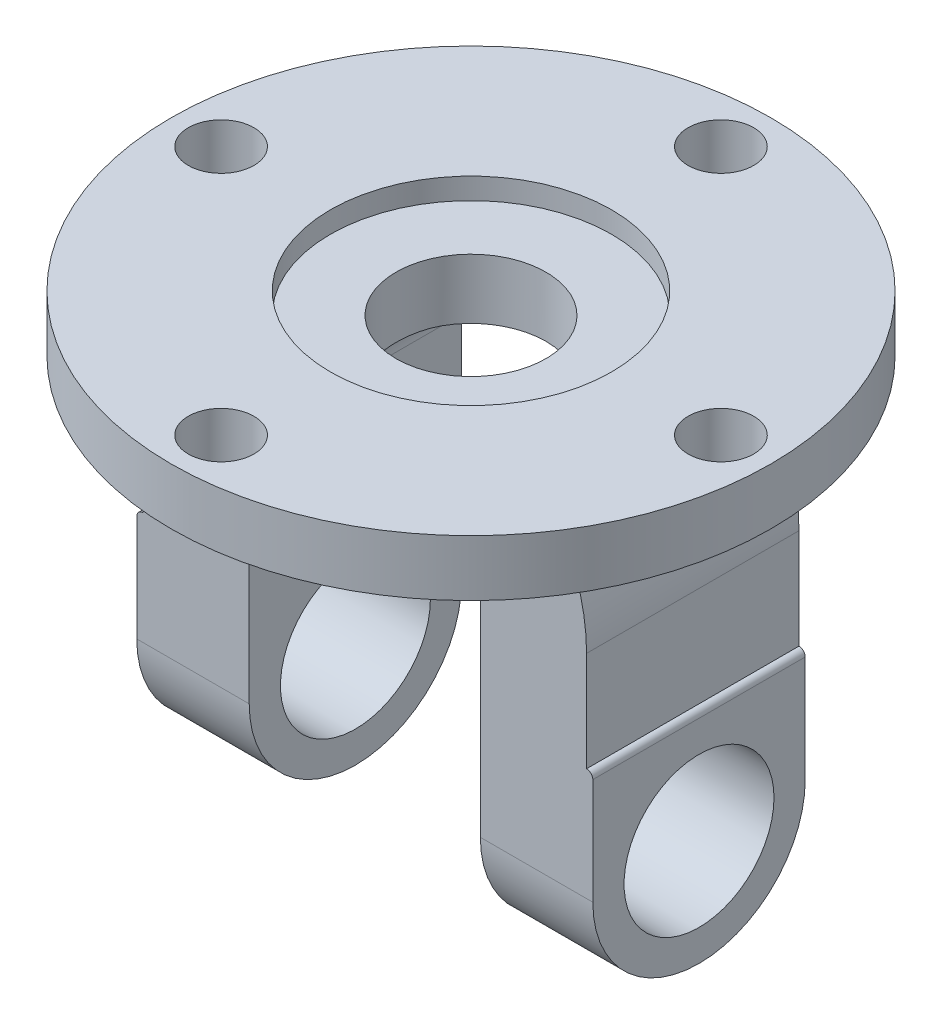
ISO-10303-21;
HEADER;
FILE_DESCRIPTION(('STEP AP214'),'2;1');
FILE_NAME('part.step','',(''),(''),'','','');
FILE_SCHEMA(('AUTOMOTIVE_DESIGN { 1 0 10303 214 1 1 1 1 }'));
ENDSEC;
DATA;
#1=APPLICATION_CONTEXT('core data for automotive mechanical design processes');
#2=APPLICATION_PROTOCOL_DEFINITION('international standard','automotive_design',2000,#1);
#3=PRODUCT_CONTEXT('',#1,'mechanical');
#4=PRODUCT('Part','Part','',(#3));
#5=PRODUCT_RELATED_PRODUCT_CATEGORY('part','',(#4));
#6=PRODUCT_DEFINITION_FORMATION('','',#4);
#7=PRODUCT_DEFINITION_CONTEXT('part definition',#1,'design');
#8=PRODUCT_DEFINITION('design','',#6,#7);
#9=PRODUCT_DEFINITION_SHAPE('','',#8);
#10=(LENGTH_UNIT() NAMED_UNIT(*) SI_UNIT(.MILLI.,.METRE.));
#11=(NAMED_UNIT(*) PLANE_ANGLE_UNIT() SI_UNIT($,.RADIAN.));
#12=(NAMED_UNIT(*) SI_UNIT($,.STERADIAN.) SOLID_ANGLE_UNIT());
#13=UNCERTAINTY_MEASURE_WITH_UNIT(LENGTH_MEASURE(1.E-05),#10,'distance_accuracy_value','');
#14=(GEOMETRIC_REPRESENTATION_CONTEXT(3) GLOBAL_UNCERTAINTY_ASSIGNED_CONTEXT((#13)) GLOBAL_UNIT_ASSIGNED_CONTEXT((#10,
#11,#12)) REPRESENTATION_CONTEXT('',''));
#15=CARTESIAN_POINT('',(0.,0.,0.));
#16=DIRECTION('',(0.,0.,1.));
#17=DIRECTION('',(1.,0.,0.));
#18=AXIS2_PLACEMENT_3D('',#15,#16,#17);
#19=CARTESIAN_POINT('',(10.5,-12.,-17.));
#20=DIRECTION('',(0.,0.,1.));
#21=DIRECTION('',(1.,0.,0.));
#22=AXIS2_PLACEMENT_3D('',#19,#20,#21);
#23=CYLINDRICAL_SURFACE('',#22,8.);
#24=DIRECTION('',(0.,0.,1.));
#25=VECTOR('',#24,1.);
#26=CARTESIAN_POINT('',(10.5,-4.,-17.));
#27=LINE('',#26,#25);
#28=CARTESIAN_POINT('',(10.5,-4.,5.80947501931113));
#29=VERTEX_POINT('',#28);
#30=CARTESIAN_POINT('',(10.5,-4.,17.));
#31=VERTEX_POINT('',#30);
#32=EDGE_CURVE('E221',#29,#31,#27,.T.);
#33=ORIENTED_EDGE('',*,*,#32,.F.);
#34=CARTESIAN_POINT('',(10.5,-4.,5.80947501931113));
#35=CARTESIAN_POINT('',(10.582396313583,-4.00000478507137,5.66055313742475));
#36=CARTESIAN_POINT('',(10.6616097143964,-4.0012723056501,5.50990261729896));
#37=CARTESIAN_POINT('',(10.8135435976927,-4.00578458406282,5.2054037349143));
#38=CARTESIAN_POINT('',(10.8862645502737,-4.00902919860814,5.05155560518061));
#39=CARTESIAN_POINT('',(11.0944631169157,-4.02090380732131,4.58568801382884));
#40=CARTESIAN_POINT('',(11.2200386237681,-4.03167539543472,4.26923291166803));
#41=CARTESIAN_POINT('',(11.4436209860505,-4.05505225948348,3.62750903118995));
#42=CARTESIAN_POINT('',(11.5416782862418,-4.06765411504085,3.30225759429498));
#43=CARTESIAN_POINT('',(11.7098899459498,-4.09156179595261,2.64455455547074));
#44=CARTESIAN_POINT('',(11.7800444650853,-4.10286762872069,2.31210299474154));
#45=CARTESIAN_POINT('',(11.8912362108495,-4.121700209188,1.64649381657088));
#46=CARTESIAN_POINT('',(11.9326231474557,-4.12927200791181,1.31339588986459));
#47=CARTESIAN_POINT('',(11.9873551544606,-4.13943031134307,0.644827293568663));
#48=CARTESIAN_POINT('',(12.0007007047885,-4.14201690137245,0.309356664686493));
#49=CARTESIAN_POINT('',(11.9992426238098,-4.14173863548621,-0.361512432389894));
#50=CARTESIAN_POINT('',(11.9844396851411,-4.13887391370869,-0.696910902156599));
#51=CARTESIAN_POINT('',(11.9268057364954,-4.12820995164931,-1.36520994455079));
#52=CARTESIAN_POINT('',(11.8839743880088,-4.12041065177072,-1.69811048696075));
#53=CARTESIAN_POINT('',(11.7706273543271,-4.10134199323106,-2.35895944365431));
#54=CARTESIAN_POINT('',(11.7001197645568,-4.09007364948859,-2.68690927693927));
#55=CARTESIAN_POINT('',(11.5319303271071,-4.0663802689378,-3.33570216150465));
#56=CARTESIAN_POINT('',(11.434248760218,-4.05395524408241,-3.65654528618214));
#57=CARTESIAN_POINT('',(11.2121409740726,-4.0309763971499,-4.28958787322845));
#58=CARTESIAN_POINT('',(11.0876687830823,-4.02042584913863,-4.60177142334791));
#59=CARTESIAN_POINT('',(10.8816390646415,-4.0088131751189,-5.06143876893123));
#60=CARTESIAN_POINT('',(10.8097265842562,-4.00564427138495,-5.21325488570857));
#61=CARTESIAN_POINT('',(10.6595768848512,-4.00123988920433,-5.5137674667867));
#62=CARTESIAN_POINT('',(10.5813392190539,-4.00000454745995,-5.66246370978015));
#63=CARTESIAN_POINT('',(10.5,-4.,-5.80947501931113));
#64=B_SPLINE_CURVE_WITH_KNOTS('',3,(#34,#35,#36,#37,#38,#39,#40,#41,#42,#43,#44,#45,#46,#47,#48,
#49,#50,#51,#52,#53,#54,#55,#56,#57,#58,#59,#60,#61,#62,#63),.UNSPECIFIED.,.F.,.F.,(4,2,2,2,2,2,
2,2,2,2,2,2,2,2,4),(0.,0.510494259529536,1.02095152570326,2.04148191159962,3.06012911540456,
4.07877049191324,5.08480145699294,6.09081520368634,7.09680419614827,8.10280533854436,
9.10851244010665,10.1142091500197,11.121645556677,11.6255573664657,12.1295048010668),.UNSPECIFIED.);
#65=CARTESIAN_POINT('',(10.5,-4.,-5.80947501931113));
#66=VERTEX_POINT('',#65);
#67=EDGE_CURVE('E298',#29,#66,#64,.T.);
#68=ORIENTED_EDGE('',*,*,#67,.T.);
#69=CARTESIAN_POINT('',(10.5,-4.,-17.));
#70=VERTEX_POINT('',#69);
#71=EDGE_CURVE('E218',#70,#66,#27,.T.);
#72=ORIENTED_EDGE('',*,*,#71,.F.);
#73=CARTESIAN_POINT('',(10.5,-12.,-17.));
#74=DIRECTION('',(0.,0.,-1.));
#75=DIRECTION('',(1.,0.,0.));
#76=AXIS2_PLACEMENT_3D('',#73,#74,#75);
#77=CIRCLE('',#76,8.);
#78=CARTESIAN_POINT('',(18.5,-12.,-17.));
#79=VERTEX_POINT('',#78);
#80=EDGE_CURVE('E202',#70,#79,#77,.T.);
#81=ORIENTED_EDGE('',*,*,#80,.T.);
#82=DIRECTION('',(0.,0.,1.));
#83=VECTOR('',#82,1.);
#84=CARTESIAN_POINT('',(18.5,-12.,-17.));
#85=LINE('',#84,#83);
#86=CARTESIAN_POINT('',(18.5,-12.,17.));
#87=VERTEX_POINT('',#86);
#88=EDGE_CURVE('E216',#79,#87,#85,.T.);
#89=ORIENTED_EDGE('',*,*,#88,.T.);
#90=CARTESIAN_POINT('',(10.5,-12.,17.));
#91=DIRECTION('',(0.,0.,-1.));
#92=DIRECTION('',(1.,0.,0.));
#93=AXIS2_PLACEMENT_3D('',#90,#91,#92);
#94=CIRCLE('',#93,8.);
#95=EDGE_CURVE('E354',#31,#87,#94,.T.);
#96=ORIENTED_EDGE('',*,*,#95,.F.);
#97=EDGE_LOOP('',(#33,#68,#72,#81,#89,#96));
#98=FACE_BOUND('',#97,.T.);
#99=ADVANCED_FACE('F49',(#98),#23,.F.);
#100=CARTESIAN_POINT('',(-10.5,-4.,-17.));
#101=DIRECTION('',(0.,-1.,0.));
#102=DIRECTION('',(0.,0.,-1.));
#103=AXIS2_PLACEMENT_3D('',#100,#101,#102);
#104=PLANE('',#103);
#105=DIRECTION('',(0.,0.,1.));
#106=VECTOR('',#105,1.);
#107=CARTESIAN_POINT('',(-10.5,-4.,-17.));
#108=LINE('',#107,#106);
#109=CARTESIAN_POINT('',(-10.5,-4.,5.80947501931113));
#110=VERTEX_POINT('',#109);
#111=CARTESIAN_POINT('',(-10.5,-4.,17.));
#112=VERTEX_POINT('',#111);
#113=EDGE_CURVE('E225',#110,#112,#108,.T.);
#114=ORIENTED_EDGE('',*,*,#113,.F.);
#115=CARTESIAN_POINT('',(0.,-4.,0.));
#116=DIRECTION('',(0.,-1.,0.));
#117=DIRECTION('',(0.,0.,-1.));
#118=AXIS2_PLACEMENT_3D('',#115,#116,#117);
#119=CIRCLE('',#118,12.);
#120=EDGE_CURVE('E308',#110,#29,#119,.F.);
#121=ORIENTED_EDGE('',*,*,#120,.T.);
#122=ORIENTED_EDGE('',*,*,#32,.T.);
#123=DIRECTION('',(1.,0.,0.));
#124=VECTOR('',#123,1.);
#125=CARTESIAN_POINT('',(-10.5,-4.,17.));
#126=LINE('',#125,#124);
#127=EDGE_CURVE('E342',#112,#31,#126,.T.);
#128=ORIENTED_EDGE('',*,*,#127,.F.);
#129=EDGE_LOOP('',(#114,#121,#122,#128));
#130=FACE_BOUND('',#129,.T.);
#131=ADVANCED_FACE('F313',(#130),#104,.T.);
#132=CARTESIAN_POINT('',(-10.5,-12.,-17.));
#133=DIRECTION('',(0.,0.,1.));
#134=DIRECTION('',(1.,0.,0.));
#135=AXIS2_PLACEMENT_3D('',#132,#133,#134);
#136=CYLINDRICAL_SURFACE('',#135,8.);
#137=CARTESIAN_POINT('',(-10.5,-4.,-17.));
#138=VERTEX_POINT('',#137);
#139=CARTESIAN_POINT('',(-10.5,-4.,-5.80947501931113));
#140=VERTEX_POINT('',#139);
#141=EDGE_CURVE('E222',#138,#140,#108,.T.);
#142=ORIENTED_EDGE('',*,*,#141,.T.);
#143=CARTESIAN_POINT('',(-10.5,-4.,-5.80947501931113));
#144=CARTESIAN_POINT('',(-10.582396313583,-4.00000478507137,-5.66055313742475));
#145=CARTESIAN_POINT('',(-10.6616097143964,-4.0012723056501,-5.50990261729896));
#146=CARTESIAN_POINT('',(-10.8135435976927,-4.00578458406282,-5.2054037349143));
#147=CARTESIAN_POINT('',(-10.8862645502737,-4.00902919860814,-5.05155560518061));
#148=CARTESIAN_POINT('',(-11.0944631169157,-4.02090380732131,-4.58568801382884));
#149=CARTESIAN_POINT('',(-11.2200386237681,-4.03167539543472,-4.26923291166803));
#150=CARTESIAN_POINT('',(-11.4436209860505,-4.05505225948348,-3.62750903118995));
#151=CARTESIAN_POINT('',(-11.5416782862418,-4.06765411504085,-3.30225759429498));
#152=CARTESIAN_POINT('',(-11.7098899459498,-4.09156179595261,-2.64455455547074));
#153=CARTESIAN_POINT('',(-11.7800444650853,-4.10286762872069,-2.31210299474154));
#154=CARTESIAN_POINT('',(-11.8912362108495,-4.121700209188,-1.64649381657088));
#155=CARTESIAN_POINT('',(-11.9326231474557,-4.12927200791181,-1.31339588986459));
#156=CARTESIAN_POINT('',(-11.9873551544606,-4.13943031134307,-0.644827293568663));
#157=CARTESIAN_POINT('',(-12.0007007047885,-4.14201690137245,-0.309356664686493));
#158=CARTESIAN_POINT('',(-11.9992426238098,-4.14173863548621,0.361512432389894));
#159=CARTESIAN_POINT('',(-11.9844396851411,-4.13887391370869,0.696910902156599));
#160=CARTESIAN_POINT('',(-11.9268057364954,-4.12820995164931,1.36520994455079));
#161=CARTESIAN_POINT('',(-11.8839743880088,-4.12041065177072,1.69811048696075));
#162=CARTESIAN_POINT('',(-11.7706273543271,-4.10134199323106,2.35895944365431));
#163=CARTESIAN_POINT('',(-11.7001197645568,-4.09007364948859,2.68690927693927));
#164=CARTESIAN_POINT('',(-11.5319303271071,-4.0663802689378,3.33570216150465));
#165=CARTESIAN_POINT('',(-11.434248760218,-4.05395524408241,3.65654528618214));
#166=CARTESIAN_POINT('',(-11.2121409740726,-4.0309763971499,4.28958787322845));
#167=CARTESIAN_POINT('',(-11.0876687830823,-4.02042584913863,4.60177142334791));
#168=CARTESIAN_POINT('',(-10.8816390646415,-4.0088131751189,5.06143876893123));
#169=CARTESIAN_POINT('',(-10.8097265842562,-4.00564427138495,5.21325488570857));
#170=CARTESIAN_POINT('',(-10.6595768848512,-4.00123988920433,5.5137674667867));
#171=CARTESIAN_POINT('',(-10.5813392190539,-4.00000454745995,5.66246370978015));
#172=CARTESIAN_POINT('',(-10.5,-4.,5.80947501931113));
#173=B_SPLINE_CURVE_WITH_KNOTS('',3,(#143,#144,#145,#146,#147,#148,#149,#150,#151,#152,#153,
#154,#155,#156,#157,#158,#159,#160,#161,#162,#163,#164,#165,#166,#167,#168,#169,#170,#171,#172),
.UNSPECIFIED.,.F.,.F.,(4,2,2,2,2,2,2,2,2,2,2,2,2,2,4),(0.,0.510494259529536,1.02095152570326,
2.04148191159962,3.06012911540456,4.07877049191324,5.08480145699294,6.09081520368634,
7.09680419614827,8.10280533854436,9.10851244010665,10.1142091500197,11.121645556677,
11.6255573664657,12.1295048010668),.UNSPECIFIED.);
#174=EDGE_CURVE('E275',#140,#110,#173,.T.);
#175=ORIENTED_EDGE('',*,*,#174,.T.);
#176=ORIENTED_EDGE('',*,*,#113,.T.);
#177=CARTESIAN_POINT('',(-10.5,-12.,17.));
#178=DIRECTION('',(0.,0.,-1.));
#179=DIRECTION('',(-1.,0.,0.));
#180=AXIS2_PLACEMENT_3D('',#177,#178,#179);
#181=CIRCLE('',#180,8.);
#182=CARTESIAN_POINT('',(-18.5,-12.,17.));
#183=VERTEX_POINT('',#182);
#184=EDGE_CURVE('E346',#183,#112,#181,.T.);
#185=ORIENTED_EDGE('',*,*,#184,.F.);
#186=DIRECTION('',(0.,0.,1.));
#187=VECTOR('',#186,1.);
#188=CARTESIAN_POINT('',(-18.5,-12.,-17.));
#189=LINE('',#188,#187);
#190=CARTESIAN_POINT('',(-18.5,-12.,-17.));
#191=VERTEX_POINT('',#190);
#192=EDGE_CURVE('E226',#191,#183,#189,.T.);
#193=ORIENTED_EDGE('',*,*,#192,.F.);
#194=CARTESIAN_POINT('',(-10.5,-12.,-17.));
#195=DIRECTION('',(0.,0.,-1.));
#196=DIRECTION('',(-1.,0.,0.));
#197=AXIS2_PLACEMENT_3D('',#194,#195,#196);
#198=CIRCLE('',#197,8.);
#199=EDGE_CURVE('E390',#191,#138,#198,.T.);
#200=ORIENTED_EDGE('',*,*,#199,.T.);
#201=EDGE_LOOP('',(#142,#175,#176,#185,#193,#200));
#202=FACE_BOUND('',#201,.T.);
#203=ADVANCED_FACE('F285',(#202),#136,.F.);
#204=CARTESIAN_POINT('',(0.,9.,0.));
#205=DIRECTION('',(0.,1.,0.));
#206=DIRECTION('',(0.,0.,1.));
#207=AXIS2_PLACEMENT_3D('',#204,#205,#206);
#208=PLANE('',#207);
#209=CARTESIAN_POINT('',(0.,9.,0.));
#210=DIRECTION('',(0.,1.,0.));
#211=DIRECTION('',(0.,0.,1.));
#212=AXIS2_PLACEMENT_3D('',#209,#210,#211);
#213=CIRCLE('',#212,22.5);
#214=CARTESIAN_POINT('',(0.,9.,22.5));
#215=VERTEX_POINT('',#214);
#216=EDGE_CURVE('E241',#215,#215,#213,.T.);
#217=ORIENTED_EDGE('',*,*,#216,.F.);
#218=EDGE_LOOP('',(#217));
#219=FACE_BOUND('',#218,.T.);
#220=CARTESIAN_POINT('',(2.25904099284255E-12,9.,40.));
#221=DIRECTION('',(0.,1.,0.));
#222=DIRECTION('',(0.,0.,1.));
#223=AXIS2_PLACEMENT_3D('',#220,#221,#222);
#224=CIRCLE('',#223,5.25000000000243);
#225=CARTESIAN_POINT('',(2.25904099284255E-12,9.,45.2500000000024));
#226=VERTEX_POINT('',#225);
#227=EDGE_CURVE('E254',#226,#226,#224,.T.);
#228=ORIENTED_EDGE('',*,*,#227,.F.);
#229=EDGE_LOOP('',(#228));
#230=FACE_BOUND('',#229,.T.);
#231=CARTESIAN_POINT('',(0.,9.,-40.));
#232=DIRECTION('',(0.,1.,0.));
#233=DIRECTION('',(0.,0.,1.));
#234=AXIS2_PLACEMENT_3D('',#231,#232,#233);
#235=CIRCLE('',#234,5.25);
#236=CARTESIAN_POINT('',(0.,9.,-34.75));
#237=VERTEX_POINT('',#236);
#238=EDGE_CURVE('E266',#237,#237,#235,.T.);
#239=ORIENTED_EDGE('',*,*,#238,.F.);
#240=EDGE_LOOP('',(#239));
#241=FACE_BOUND('',#240,.T.);
#242=CARTESIAN_POINT('',(0.,9.,0.));
#243=DIRECTION('',(0.,1.,0.));
#244=DIRECTION('',(0.,0.,1.));
#245=AXIS2_PLACEMENT_3D('',#242,#243,#244);
#246=CIRCLE('',#245,48.);
#247=CARTESIAN_POINT('',(0.,9.,48.));
#248=VERTEX_POINT('',#247);
#249=EDGE_CURVE('E272',#248,#248,#246,.T.);
#250=ORIENTED_EDGE('',*,*,#249,.T.);
#251=EDGE_LOOP('',(#250));
#252=FACE_BOUND('',#251,.T.);
#253=CARTESIAN_POINT('',(40.0000000000011,9.,-1.12952049642128E-12));
#254=DIRECTION('',(0.,1.,0.));
#255=DIRECTION('',(0.,0.,1.));
#256=AXIS2_PLACEMENT_3D('',#253,#254,#255);
#257=CIRCLE('',#256,5.25000000000088);
#258=CARTESIAN_POINT('',(40.0000000000011,9.,5.24999999999975));
#259=VERTEX_POINT('',#258);
#260=EDGE_CURVE('E260',#259,#259,#257,.T.);
#261=ORIENTED_EDGE('',*,*,#260,.F.);
#262=EDGE_LOOP('',(#261));
#263=FACE_BOUND('',#262,.T.);
#264=CARTESIAN_POINT('',(-39.9999999999989,9.,1.13441908361787E-12));
#265=DIRECTION('',(0.,1.,0.));
#266=DIRECTION('',(0.,0.,1.));
#267=AXIS2_PLACEMENT_3D('',#264,#265,#266);
#268=CIRCLE('',#267,5.25000000000181);
#269=CARTESIAN_POINT('',(-39.9999999999989,9.,5.25000000000295));
#270=VERTEX_POINT('',#269);
#271=EDGE_CURVE('E248',#270,#270,#268,.T.);
#272=ORIENTED_EDGE('',*,*,#271,.F.);
#273=EDGE_LOOP('',(#272));
#274=FACE_BOUND('',#273,.T.);
#275=ADVANCED_FACE('F335',(#219,#230,#241,#252,#263,#274),#208,.T.);
#276=CARTESIAN_POINT('',(0.,0.,0.));
#277=DIRECTION('',(0.,1.,0.));
#278=DIRECTION('',(0.,0.,1.));
#279=AXIS2_PLACEMENT_3D('',#276,#277,#278);
#280=PLANE('',#279);
#281=DIRECTION('',(-1.,0.,0.));
#282=VECTOR('',#281,1.);
#283=CARTESIAN_POINT('',(31.5,0.,-17.));
#284=LINE('',#283,#282);
#285=CARTESIAN_POINT('',(31.5,0.,-17.));
#286=VERTEX_POINT('',#285);
#287=CARTESIAN_POINT('',(-31.5,0.,-17.));
#288=VERTEX_POINT('',#287);
#289=EDGE_CURVE('E374',#286,#288,#284,.T.);
#290=ORIENTED_EDGE('',*,*,#289,.T.);
#291=DIRECTION('',(0.,0.,1.));
#292=VECTOR('',#291,1.);
#293=CARTESIAN_POINT('',(-31.5,0.,-17.));
#294=LINE('',#293,#292);
#295=CARTESIAN_POINT('',(-31.5,0.,17.));
#296=VERTEX_POINT('',#295);
#297=EDGE_CURVE('E235',#288,#296,#294,.T.);
#298=ORIENTED_EDGE('',*,*,#297,.T.);
#299=DIRECTION('',(-1.,0.,0.));
#300=VECTOR('',#299,1.);
#301=CARTESIAN_POINT('',(31.5,0.,17.));
#302=LINE('',#301,#300);
#303=CARTESIAN_POINT('',(31.5,0.,17.));
#304=VERTEX_POINT('',#303);
#305=EDGE_CURVE('E438',#304,#296,#302,.T.);
#306=ORIENTED_EDGE('',*,*,#305,.F.);
#307=DIRECTION('',(0.,0.,1.));
#308=VECTOR('',#307,1.);
#309=CARTESIAN_POINT('',(31.5,0.,-17.));
#310=LINE('',#309,#308);
#311=EDGE_CURVE('E208',#286,#304,#310,.T.);
#312=ORIENTED_EDGE('',*,*,#311,.F.);
#313=EDGE_LOOP('',(#290,#298,#306,#312));
#314=FACE_BOUND('',#313,.T.);
#315=CARTESIAN_POINT('',(0.,0.,0.));
#316=DIRECTION('',(0.,1.,0.));
#317=DIRECTION('',(0.,0.,1.));
#318=AXIS2_PLACEMENT_3D('',#315,#316,#317);
#319=CIRCLE('',#318,48.);
#320=CARTESIAN_POINT('',(0.,0.,48.));
#321=VERTEX_POINT('',#320);
#322=EDGE_CURVE('E269',#321,#321,#319,.T.);
#323=ORIENTED_EDGE('',*,*,#322,.F.);
#324=EDGE_LOOP('',(#323));
#325=FACE_BOUND('',#324,.T.);
#326=CARTESIAN_POINT('',(0.,0.,-40.));
#327=DIRECTION('',(0.,1.,0.));
#328=DIRECTION('',(0.,0.,1.));
#329=AXIS2_PLACEMENT_3D('',#326,#327,#328);
#330=CIRCLE('',#329,5.25);
#331=CARTESIAN_POINT('',(0.,0.,-34.75));
#332=VERTEX_POINT('',#331);
#333=EDGE_CURVE('E263',#332,#332,#330,.T.);
#334=ORIENTED_EDGE('',*,*,#333,.T.);
#335=EDGE_LOOP('',(#334));
#336=FACE_BOUND('',#335,.T.);
#337=CARTESIAN_POINT('',(2.25904099284255E-12,0.,40.));
#338=DIRECTION('',(0.,1.,0.));
#339=DIRECTION('',(0.,0.,1.));
#340=AXIS2_PLACEMENT_3D('',#337,#338,#339);
#341=CIRCLE('',#340,5.25000000000243);
#342=CARTESIAN_POINT('',(2.25904099284255E-12,0.,45.2500000000024));
#343=VERTEX_POINT('',#342);
#344=EDGE_CURVE('E251',#343,#343,#341,.T.);
#345=ORIENTED_EDGE('',*,*,#344,.T.);
#346=EDGE_LOOP('',(#345));
#347=FACE_BOUND('',#346,.T.);
#348=CARTESIAN_POINT('',(-39.9999999999989,0.,1.13441908361787E-12));
#349=DIRECTION('',(0.,1.,0.));
#350=DIRECTION('',(0.,0.,1.));
#351=AXIS2_PLACEMENT_3D('',#348,#349,#350);
#352=CIRCLE('',#351,5.25000000000181);
#353=CARTESIAN_POINT('',(-39.9999999999989,0.,5.25000000000295));
#354=VERTEX_POINT('',#353);
#355=EDGE_CURVE('E245',#354,#354,#352,.T.);
#356=ORIENTED_EDGE('',*,*,#355,.T.);
#357=EDGE_LOOP('',(#356));
#358=FACE_BOUND('',#357,.T.);
#359=CARTESIAN_POINT('',(40.0000000000011,0.,-1.12952049642128E-12));
#360=DIRECTION('',(0.,1.,0.));
#361=DIRECTION('',(0.,0.,1.));
#362=AXIS2_PLACEMENT_3D('',#359,#360,#361);
#363=CIRCLE('',#362,5.25000000000088);
#364=CARTESIAN_POINT('',(40.0000000000011,0.,5.24999999999975));
#365=VERTEX_POINT('',#364);
#366=EDGE_CURVE('E257',#365,#365,#363,.T.);
#367=ORIENTED_EDGE('',*,*,#366,.T.);
#368=EDGE_LOOP('',(#367));
#369=FACE_BOUND('',#368,.T.);
#370=ADVANCED_FACE('F449',(#314,#325,#336,#347,#358,#369),#280,.F.);
#371=CARTESIAN_POINT('',(0.,9.,0.));
#372=DIRECTION('',(0.,-1.,0.));
#373=DIRECTION('',(0.,0.,-1.));
#374=AXIS2_PLACEMENT_3D('',#371,#372,#373);
#375=CYLINDRICAL_SURFACE('',#374,48.);
#376=ORIENTED_EDGE('',*,*,#249,.F.);
#377=EDGE_LOOP('',(#376));
#378=FACE_BOUND('',#377,.T.);
#379=ORIENTED_EDGE('',*,*,#322,.T.);
#380=EDGE_LOOP('',(#379));
#381=FACE_BOUND('',#380,.T.);
#382=ADVANCED_FACE('F51',(#378,#381),#375,.T.);
#383=CARTESIAN_POINT('',(0.,9.,-40.));
#384=DIRECTION('',(0.,-1.,0.));
#385=DIRECTION('',(0.,0.,-1.));
#386=AXIS2_PLACEMENT_3D('',#383,#384,#385);
#387=CYLINDRICAL_SURFACE('',#386,5.25);
#388=ORIENTED_EDGE('',*,*,#238,.T.);
#389=EDGE_LOOP('',(#388));
#390=FACE_BOUND('',#389,.T.);
#391=ORIENTED_EDGE('',*,*,#333,.F.);
#392=EDGE_LOOP('',(#391));
#393=FACE_BOUND('',#392,.T.);
#394=ADVANCED_FACE('F496',(#390,#393),#387,.F.);
#395=CARTESIAN_POINT('',(40.0000000000011,9.,-1.12952049642128E-12));
#396=DIRECTION('',(0.,-1.,0.));
#397=DIRECTION('',(0.,0.,-1.));
#398=AXIS2_PLACEMENT_3D('',#395,#396,#397);
#399=CYLINDRICAL_SURFACE('',#398,5.25000000000088);
#400=ORIENTED_EDGE('',*,*,#260,.T.);
#401=EDGE_LOOP('',(#400));
#402=FACE_BOUND('',#401,.T.);
#403=ORIENTED_EDGE('',*,*,#366,.F.);
#404=EDGE_LOOP('',(#403));
#405=FACE_BOUND('',#404,.T.);
#406=ADVANCED_FACE('F492',(#402,#405),#399,.F.);
#407=CARTESIAN_POINT('',(2.25904099284255E-12,9.,40.));
#408=DIRECTION('',(0.,-1.,0.));
#409=DIRECTION('',(0.,0.,-1.));
#410=AXIS2_PLACEMENT_3D('',#407,#408,#409);
#411=CYLINDRICAL_SURFACE('',#410,5.25000000000243);
#412=ORIENTED_EDGE('',*,*,#227,.T.);
#413=EDGE_LOOP('',(#412));
#414=FACE_BOUND('',#413,.T.);
#415=ORIENTED_EDGE('',*,*,#344,.F.);
#416=EDGE_LOOP('',(#415));
#417=FACE_BOUND('',#416,.T.);
#418=ADVANCED_FACE('F488',(#414,#417),#411,.F.);
#419=CARTESIAN_POINT('',(-39.9999999999989,9.,1.13441908361787E-12));
#420=DIRECTION('',(0.,-1.,0.));
#421=DIRECTION('',(0.,0.,-1.));
#422=AXIS2_PLACEMENT_3D('',#419,#420,#421);
#423=CYLINDRICAL_SURFACE('',#422,5.25000000000181);
#424=ORIENTED_EDGE('',*,*,#271,.T.);
#425=EDGE_LOOP('',(#424));
#426=FACE_BOUND('',#425,.T.);
#427=ORIENTED_EDGE('',*,*,#355,.F.);
#428=EDGE_LOOP('',(#427));
#429=FACE_BOUND('',#428,.T.);
#430=ADVANCED_FACE('F484',(#426,#429),#423,.F.);
#431=CARTESIAN_POINT('',(0.,5.6,0.));
#432=DIRECTION('',(0.,1.,0.));
#433=DIRECTION('',(0.,0.,1.));
#434=AXIS2_PLACEMENT_3D('',#431,#432,#433);
#435=CYLINDRICAL_SURFACE('',#434,22.5);
#436=CARTESIAN_POINT('',(0.,5.6,0.));
#437=DIRECTION('',(0.,1.,0.));
#438=DIRECTION('',(0.,0.,1.));
#439=AXIS2_PLACEMENT_3D('',#436,#437,#438);
#440=CIRCLE('',#439,22.5);
#441=CARTESIAN_POINT('',(0.,5.6,22.5));
#442=VERTEX_POINT('',#441);
#443=EDGE_CURVE('E242',#442,#442,#440,.T.);
#444=ORIENTED_EDGE('',*,*,#443,.F.);
#445=EDGE_LOOP('',(#444));
#446=FACE_BOUND('',#445,.T.);
#447=ORIENTED_EDGE('',*,*,#216,.T.);
#448=EDGE_LOOP('',(#447));
#449=FACE_BOUND('',#448,.T.);
#450=ADVANCED_FACE('F480',(#446,#449),#435,.F.);
#451=CARTESIAN_POINT('',(0.,5.6,0.));
#452=DIRECTION('',(0.,1.,0.));
#453=DIRECTION('',(0.,0.,1.));
#454=AXIS2_PLACEMENT_3D('',#451,#452,#453);
#455=PLANE('',#454);
#456=CARTESIAN_POINT('',(0.,5.6,0.));
#457=DIRECTION('',(0.,1.,0.));
#458=DIRECTION('',(0.,0.,1.));
#459=AXIS2_PLACEMENT_3D('',#456,#457,#458);
#460=CIRCLE('',#459,12.);
#461=CARTESIAN_POINT('',(0.,5.6,12.));
#462=VERTEX_POINT('',#461);
#463=EDGE_CURVE('E211',#462,#462,#460,.T.);
#464=ORIENTED_EDGE('',*,*,#463,.F.);
#465=EDGE_LOOP('',(#464));
#466=FACE_BOUND('',#465,.T.);
#467=ORIENTED_EDGE('',*,*,#443,.T.);
#468=EDGE_LOOP('',(#467));
#469=FACE_BOUND('',#468,.T.);
#470=ADVANCED_FACE('F476',(#466,#469),#455,.T.);
#471=CARTESIAN_POINT('',(0.,0.,0.));
#472=DIRECTION('',(0.,1.,0.));
#473=DIRECTION('',(0.,0.,1.));
#474=AXIS2_PLACEMENT_3D('',#471,#472,#473);
#475=CYLINDRICAL_SURFACE('',#474,12.);
#476=ORIENTED_EDGE('',*,*,#120,.F.);
#477=ORIENTED_EDGE('',*,*,#174,.F.);
#478=EDGE_CURVE('E190',#66,#140,#119,.F.);
#479=ORIENTED_EDGE('',*,*,#478,.F.);
#480=ORIENTED_EDGE('',*,*,#67,.F.);
#481=EDGE_LOOP('',(#476,#477,#479,#480));
#482=FACE_BOUND('',#481,.T.);
#483=ORIENTED_EDGE('',*,*,#463,.T.);
#484=EDGE_LOOP('',(#483));
#485=FACE_BOUND('',#484,.T.);
#486=ADVANCED_FACE('F474',(#482,#485),#475,.F.);
#487=CARTESIAN_POINT('',(5.37499999999992,-15.,-17.));
#488=DIRECTION('',(0.,0.,1.));
#489=DIRECTION('',(1.,0.,0.));
#490=AXIS2_PLACEMENT_3D('',#487,#488,#489);
#491=CYLINDRICAL_SURFACE('',#490,30.1250000000001);
#492=ORIENTED_EDGE('',*,*,#311,.T.);
#493=CARTESIAN_POINT('',(5.37499999999992,-15.,17.));
#494=DIRECTION('',(0.,0.,1.));
#495=DIRECTION('',(-1.,0.,0.));
#496=AXIS2_PLACEMENT_3D('',#493,#494,#495);
#497=CIRCLE('',#496,30.1250000000001);
#498=CARTESIAN_POINT('',(35.5,-15.,17.));
#499=VERTEX_POINT('',#498);
#500=EDGE_CURVE('E307',#499,#304,#497,.T.);
#501=ORIENTED_EDGE('',*,*,#500,.F.);
#502=DIRECTION('',(0.,0.,1.));
#503=VECTOR('',#502,1.);
#504=CARTESIAN_POINT('',(35.5,-15.,-17.));
#505=LINE('',#504,#503);
#506=CARTESIAN_POINT('',(35.5,-15.,-17.));
#507=VERTEX_POINT('',#506);
#508=EDGE_CURVE('E209',#507,#499,#505,.T.);
#509=ORIENTED_EDGE('',*,*,#508,.F.);
#510=CARTESIAN_POINT('',(5.37499999999992,-15.,-17.));
#511=DIRECTION('',(0.,0.,1.));
#512=DIRECTION('',(-1.,0.,0.));
#513=AXIS2_PLACEMENT_3D('',#510,#511,#512);
#514=CIRCLE('',#513,30.1250000000001);
#515=EDGE_CURVE('E371',#507,#286,#514,.T.);
#516=ORIENTED_EDGE('',*,*,#515,.T.);
#517=EDGE_LOOP('',(#492,#501,#509,#516));
#518=FACE_BOUND('',#517,.T.);
#519=ADVANCED_FACE('F445',(#518),#491,.T.);
#520=CARTESIAN_POINT('',(35.5,-31.,-17.));
#521=DIRECTION('',(1.,0.,0.));
#522=DIRECTION('',(0.,1.,0.));
#523=AXIS2_PLACEMENT_3D('',#520,#521,#522);
#524=PLANE('',#523);
#525=ORIENTED_EDGE('',*,*,#508,.T.);
#526=DIRECTION('',(0.,1.,0.));
#527=VECTOR('',#526,1.);
#528=CARTESIAN_POINT('',(35.5,-31.,17.));
#529=LINE('',#528,#527);
#530=CARTESIAN_POINT('',(35.5,-31.,17.));
#531=VERTEX_POINT('',#530);
#532=EDGE_CURVE('E368',#531,#499,#529,.T.);
#533=ORIENTED_EDGE('',*,*,#532,.F.);
#534=DIRECTION('',(0.,0.,1.));
#535=VECTOR('',#534,1.);
#536=CARTESIAN_POINT('',(35.5,-31.,-17.));
#537=LINE('',#536,#535);
#538=CARTESIAN_POINT('',(35.5,-31.,-17.));
#539=VERTEX_POINT('',#538);
#540=EDGE_CURVE('E212',#539,#531,#537,.T.);
#541=ORIENTED_EDGE('',*,*,#540,.F.);
#542=DIRECTION('',(0.,1.,0.));
#543=VECTOR('',#542,1.);
#544=CARTESIAN_POINT('',(35.5,-31.,-17.));
#545=LINE('',#544,#543);
#546=EDGE_CURVE('E200',#539,#507,#545,.T.);
#547=ORIENTED_EDGE('',*,*,#546,.T.);
#548=EDGE_LOOP('',(#525,#533,#541,#547));
#549=FACE_BOUND('',#548,.T.);
#550=ADVANCED_FACE('F473',(#549),#524,.T.);
#551=CARTESIAN_POINT('',(35.5,-32.,-17.));
#552=DIRECTION('',(0.,0.,1.));
#553=DIRECTION('',(1.,0.,0.));
#554=AXIS2_PLACEMENT_3D('',#551,#552,#553);
#555=CYLINDRICAL_SURFACE('',#554,0.999999999999997);
#556=ORIENTED_EDGE('',*,*,#540,.T.);
#557=CARTESIAN_POINT('',(35.5,-32.,17.));
#558=DIRECTION('',(0.,0.,1.));
#559=DIRECTION('',(-1.,0.,0.));
#560=AXIS2_PLACEMENT_3D('',#557,#558,#559);
#561=CIRCLE('',#560,0.999999999999997);
#562=CARTESIAN_POINT('',(36.5,-32.,17.));
#563=VERTEX_POINT('',#562);
#564=EDGE_CURVE('E365',#563,#531,#561,.T.);
#565=ORIENTED_EDGE('',*,*,#564,.F.);
#566=DIRECTION('',(0.,0.,1.));
#567=VECTOR('',#566,1.);
#568=CARTESIAN_POINT('',(36.5,-32.,-17.));
#569=LINE('',#568,#567);
#570=CARTESIAN_POINT('',(36.5,-32.,-17.));
#571=VERTEX_POINT('',#570);
#572=EDGE_CURVE('E214',#571,#563,#569,.T.);
#573=ORIENTED_EDGE('',*,*,#572,.F.);
#574=CARTESIAN_POINT('',(35.5,-32.,-17.));
#575=DIRECTION('',(0.,0.,1.));
#576=DIRECTION('',(-1.,0.,0.));
#577=AXIS2_PLACEMENT_3D('',#574,#575,#576);
#578=CIRCLE('',#577,0.999999999999997);
#579=EDGE_CURVE('E197',#571,#539,#578,.T.);
#580=ORIENTED_EDGE('',*,*,#579,.T.);
#581=EDGE_LOOP('',(#556,#565,#573,#580));
#582=FACE_BOUND('',#581,.T.);
#583=ADVANCED_FACE('F564',(#582),#555,.T.);
#584=CARTESIAN_POINT('',(36.5,-66.,-17.));
#585=DIRECTION('',(1.,0.,0.));
#586=DIRECTION('',(0.,0.,-1.));
#587=AXIS2_PLACEMENT_3D('',#584,#585,#586);
#588=PLANE('',#587);
#589=CARTESIAN_POINT('',(36.5,-49.,0.));
#590=DIRECTION('',(1.,0.,0.));
#591=DIRECTION('',(0.,0.,-1.));
#592=AXIS2_PLACEMENT_3D('',#589,#590,#591);
#593=CIRCLE('',#592,12.);
#594=CARTESIAN_POINT('',(36.5,-49.,-12.));
#595=VERTEX_POINT('',#594);
#596=EDGE_CURVE('E413',#595,#595,#593,.T.);
#597=ORIENTED_EDGE('',*,*,#596,.F.);
#598=EDGE_LOOP('',(#597));
#599=FACE_BOUND('',#598,.T.);
#600=CARTESIAN_POINT('',(36.5,-49.,0.));
#601=DIRECTION('',(1.,0.,0.));
#602=DIRECTION('',(0.,0.,-1.));
#603=AXIS2_PLACEMENT_3D('',#600,#601,#602);
#604=CIRCLE('',#603,17.);
#605=CARTESIAN_POINT('',(36.5,-49.,-17.));
#606=VERTEX_POINT('',#605);
#607=CARTESIAN_POINT('',(36.5,-49.,17.));
#608=VERTEX_POINT('',#607);
#609=EDGE_CURVE('E65',#606,#608,#604,.F.);
#610=ORIENTED_EDGE('',*,*,#609,.F.);
#611=DIRECTION('',(0.,1.,0.));
#612=VECTOR('',#611,1.);
#613=CARTESIAN_POINT('',(36.5,-66.,-17.));
#614=LINE('',#613,#612);
#615=EDGE_CURVE('E187',#606,#571,#614,.T.);
#616=ORIENTED_EDGE('',*,*,#615,.T.);
#617=ORIENTED_EDGE('',*,*,#572,.T.);
#618=DIRECTION('',(0.,1.,0.));
#619=VECTOR('',#618,1.);
#620=CARTESIAN_POINT('',(36.5,-66.,17.));
#621=LINE('',#620,#619);
#622=EDGE_CURVE('E189',#608,#563,#621,.T.);
#623=ORIENTED_EDGE('',*,*,#622,.F.);
#624=EDGE_LOOP('',(#610,#616,#617,#623));
#625=FACE_BOUND('',#624,.T.);
#626=ADVANCED_FACE('F185',(#599,#625),#588,.T.);
#627=CARTESIAN_POINT('',(18.5,-66.,-17.));
#628=DIRECTION('',(-1.,0.,0.));
#629=DIRECTION('',(0.,0.,1.));
#630=AXIS2_PLACEMENT_3D('',#627,#628,#629);
#631=PLANE('',#630);
#632=CARTESIAN_POINT('',(18.5,-49.,0.));
#633=DIRECTION('',(-1.,0.,0.));
#634=DIRECTION('',(0.,0.,1.));
#635=AXIS2_PLACEMENT_3D('',#632,#633,#634);
#636=CIRCLE('',#635,12.);
#637=CARTESIAN_POINT('',(18.5,-49.,12.));
#638=VERTEX_POINT('',#637);
#639=EDGE_CURVE('E407',#638,#638,#636,.T.);
#640=ORIENTED_EDGE('',*,*,#639,.F.);
#641=EDGE_LOOP('',(#640));
#642=FACE_BOUND('',#641,.T.);
#643=CARTESIAN_POINT('',(18.5,-49.,0.));
#644=DIRECTION('',(-1.,0.,0.));
#645=DIRECTION('',(0.,0.,1.));
#646=AXIS2_PLACEMENT_3D('',#643,#644,#645);
#647=CIRCLE('',#646,17.);
#648=CARTESIAN_POINT('',(18.5,-49.,17.));
#649=VERTEX_POINT('',#648);
#650=CARTESIAN_POINT('',(18.5,-49.,-17.));
#651=VERTEX_POINT('',#650);
#652=EDGE_CURVE('E175',#649,#651,#647,.F.);
#653=ORIENTED_EDGE('',*,*,#652,.F.);
#654=DIRECTION('',(0.,-1.,0.));
#655=VECTOR('',#654,1.);
#656=CARTESIAN_POINT('',(18.5,-66.,17.));
#657=LINE('',#656,#655);
#658=EDGE_CURVE('E361',#87,#649,#657,.T.);
#659=ORIENTED_EDGE('',*,*,#658,.F.);
#660=ORIENTED_EDGE('',*,*,#88,.F.);
#661=DIRECTION('',(0.,-1.,0.));
#662=VECTOR('',#661,1.);
#663=CARTESIAN_POINT('',(18.5,-66.,-17.));
#664=LINE('',#663,#662);
#665=EDGE_CURVE('E198',#79,#651,#664,.T.);
#666=ORIENTED_EDGE('',*,*,#665,.T.);
#667=EDGE_LOOP('',(#653,#659,#660,#666));
#668=FACE_BOUND('',#667,.T.);
#669=ADVANCED_FACE('F315',(#642,#668),#631,.T.);
#670=ORIENTED_EDGE('',*,*,#71,.T.);
#671=ORIENTED_EDGE('',*,*,#478,.T.);
#672=ORIENTED_EDGE('',*,*,#141,.F.);
#673=DIRECTION('',(1.,0.,0.));
#674=VECTOR('',#673,1.);
#675=CARTESIAN_POINT('',(-10.5,-4.,-17.));
#676=LINE('',#675,#674);
#677=EDGE_CURVE('E393',#138,#70,#676,.T.);
#678=ORIENTED_EDGE('',*,*,#677,.T.);
#679=EDGE_LOOP('',(#670,#671,#672,#678));
#680=FACE_BOUND('',#679,.T.);
#681=ADVANCED_FACE('F317',(#680),#104,.T.);
#682=CARTESIAN_POINT('',(-18.5,-66.,-17.));
#683=DIRECTION('',(1.,0.,0.));
#684=DIRECTION('',(0.,0.,-1.));
#685=AXIS2_PLACEMENT_3D('',#682,#683,#684);
#686=PLANE('',#685);
#687=CARTESIAN_POINT('',(-18.5,-49.,0.));
#688=DIRECTION('',(1.,0.,0.));
#689=DIRECTION('',(0.,0.,-1.));
#690=AXIS2_PLACEMENT_3D('',#687,#688,#689);
#691=CIRCLE('',#690,12.);
#692=CARTESIAN_POINT('',(-18.5,-49.,-12.));
#693=VERTEX_POINT('',#692);
#694=EDGE_CURVE('E410',#693,#693,#691,.T.);
#695=ORIENTED_EDGE('',*,*,#694,.F.);
#696=EDGE_LOOP('',(#695));
#697=FACE_BOUND('',#696,.T.);
#698=CARTESIAN_POINT('',(-18.5,-49.,0.));
#699=DIRECTION('',(1.,0.,0.));
#700=DIRECTION('',(0.,0.,-1.));
#701=AXIS2_PLACEMENT_3D('',#698,#699,#700);
#702=CIRCLE('',#701,17.);
#703=CARTESIAN_POINT('',(-18.5,-49.,-17.));
#704=VERTEX_POINT('',#703);
#705=CARTESIAN_POINT('',(-18.5,-49.,17.));
#706=VERTEX_POINT('',#705);
#707=EDGE_CURVE('E73',#704,#706,#702,.F.);
#708=ORIENTED_EDGE('',*,*,#707,.F.);
#709=DIRECTION('',(0.,1.,0.));
#710=VECTOR('',#709,1.);
#711=CARTESIAN_POINT('',(-18.5,-66.,-17.));
#712=LINE('',#711,#710);
#713=EDGE_CURVE('E388',#704,#191,#712,.T.);
#714=ORIENTED_EDGE('',*,*,#713,.T.);
#715=ORIENTED_EDGE('',*,*,#192,.T.);
#716=DIRECTION('',(0.,1.,0.));
#717=VECTOR('',#716,1.);
#718=CARTESIAN_POINT('',(-18.5,-66.,17.));
#719=LINE('',#718,#717);
#720=EDGE_CURVE('E352',#706,#183,#719,.T.);
#721=ORIENTED_EDGE('',*,*,#720,.F.);
#722=EDGE_LOOP('',(#708,#714,#715,#721));
#723=FACE_BOUND('',#722,.T.);
#724=ADVANCED_FACE('F319',(#697,#723),#686,.T.);
#725=CARTESIAN_POINT('',(-36.5,-66.,-17.));
#726=DIRECTION('',(-1.,0.,0.));
#727=DIRECTION('',(0.,0.,1.));
#728=AXIS2_PLACEMENT_3D('',#725,#726,#727);
#729=PLANE('',#728);
#730=CARTESIAN_POINT('',(-36.5,-49.,0.));
#731=DIRECTION('',(-1.,0.,0.));
#732=DIRECTION('',(0.,0.,1.));
#733=AXIS2_PLACEMENT_3D('',#730,#731,#732);
#734=CIRCLE('',#733,12.);
#735=CARTESIAN_POINT('',(-36.5,-49.,12.));
#736=VERTEX_POINT('',#735);
#737=EDGE_CURVE('E53',#736,#736,#734,.T.);
#738=ORIENTED_EDGE('',*,*,#737,.F.);
#739=EDGE_LOOP('',(#738));
#740=FACE_BOUND('',#739,.T.);
#741=CARTESIAN_POINT('',(-36.5,-49.,0.));
#742=DIRECTION('',(-1.,0.,0.));
#743=DIRECTION('',(0.,0.,1.));
#744=AXIS2_PLACEMENT_3D('',#741,#742,#743);
#745=CIRCLE('',#744,17.);
#746=CARTESIAN_POINT('',(-36.5,-49.,17.));
#747=VERTEX_POINT('',#746);
#748=CARTESIAN_POINT('',(-36.5,-49.,-17.));
#749=VERTEX_POINT('',#748);
#750=EDGE_CURVE('E180',#747,#749,#745,.F.);
#751=ORIENTED_EDGE('',*,*,#750,.F.);
#752=DIRECTION('',(0.,-1.,0.));
#753=VECTOR('',#752,1.);
#754=CARTESIAN_POINT('',(-36.5,-66.,17.));
#755=LINE('',#754,#753);
#756=CARTESIAN_POINT('',(-36.5,-32.,17.));
#757=VERTEX_POINT('',#756);
#758=EDGE_CURVE('E356',#757,#747,#755,.T.);
#759=ORIENTED_EDGE('',*,*,#758,.F.);
#760=DIRECTION('',(0.,0.,1.));
#761=VECTOR('',#760,1.);
#762=CARTESIAN_POINT('',(-36.5,-32.,-17.));
#763=LINE('',#762,#761);
#764=CARTESIAN_POINT('',(-36.5,-32.,-17.));
#765=VERTEX_POINT('',#764);
#766=EDGE_CURVE('E229',#765,#757,#763,.T.);
#767=ORIENTED_EDGE('',*,*,#766,.F.);
#768=DIRECTION('',(0.,-1.,0.));
#769=VECTOR('',#768,1.);
#770=CARTESIAN_POINT('',(-36.5,-66.,-17.));
#771=LINE('',#770,#769);
#772=EDGE_CURVE('E385',#765,#749,#771,.T.);
#773=ORIENTED_EDGE('',*,*,#772,.T.);
#774=EDGE_LOOP('',(#751,#759,#767,#773));
#775=FACE_BOUND('',#774,.T.);
#776=ADVANCED_FACE('F326',(#740,#775),#729,.T.);
#777=CARTESIAN_POINT('',(-35.5,-32.,-17.));
#778=DIRECTION('',(0.,0.,1.));
#779=DIRECTION('',(1.,0.,0.));
#780=AXIS2_PLACEMENT_3D('',#777,#778,#779);
#781=CYLINDRICAL_SURFACE('',#780,0.999999999999997);
#782=ORIENTED_EDGE('',*,*,#766,.T.);
#783=CARTESIAN_POINT('',(-35.5,-32.,17.));
#784=DIRECTION('',(0.,0.,1.));
#785=DIRECTION('',(-1.,0.,0.));
#786=AXIS2_PLACEMENT_3D('',#783,#784,#785);
#787=CIRCLE('',#786,0.999999999999997);
#788=CARTESIAN_POINT('',(-35.5,-31.,17.));
#789=VERTEX_POINT('',#788);
#790=EDGE_CURVE('E431',#789,#757,#787,.T.);
#791=ORIENTED_EDGE('',*,*,#790,.F.);
#792=DIRECTION('',(0.,0.,1.));
#793=VECTOR('',#792,1.);
#794=CARTESIAN_POINT('',(-35.5,-31.,-17.));
#795=LINE('',#794,#793);
#796=CARTESIAN_POINT('',(-35.5,-31.,-17.));
#797=VERTEX_POINT('',#796);
#798=EDGE_CURVE('E231',#797,#789,#795,.T.);
#799=ORIENTED_EDGE('',*,*,#798,.F.);
#800=CARTESIAN_POINT('',(-35.5,-32.,-17.));
#801=DIRECTION('',(0.,0.,1.));
#802=DIRECTION('',(-1.,0.,0.));
#803=AXIS2_PLACEMENT_3D('',#800,#801,#802);
#804=CIRCLE('',#803,0.999999999999997);
#805=EDGE_CURVE('E382',#797,#765,#804,.T.);
#806=ORIENTED_EDGE('',*,*,#805,.T.);
#807=EDGE_LOOP('',(#782,#791,#799,#806));
#808=FACE_BOUND('',#807,.T.);
#809=ADVANCED_FACE('F424',(#808),#781,.T.);
#810=CARTESIAN_POINT('',(-35.5,-31.,-17.));
#811=DIRECTION('',(-1.,0.,0.));
#812=DIRECTION('',(0.,-1.,0.));
#813=AXIS2_PLACEMENT_3D('',#810,#811,#812);
#814=PLANE('',#813);
#815=ORIENTED_EDGE('',*,*,#798,.T.);
#816=DIRECTION('',(0.,-1.,0.));
#817=VECTOR('',#816,1.);
#818=CARTESIAN_POINT('',(-35.5,-31.,17.));
#819=LINE('',#818,#817);
#820=CARTESIAN_POINT('',(-35.5,-15.,17.));
#821=VERTEX_POINT('',#820);
#822=EDGE_CURVE('E432',#821,#789,#819,.T.);
#823=ORIENTED_EDGE('',*,*,#822,.F.);
#824=DIRECTION('',(0.,0.,1.));
#825=VECTOR('',#824,1.);
#826=CARTESIAN_POINT('',(-35.5,-15.,-17.));
#827=LINE('',#826,#825);
#828=CARTESIAN_POINT('',(-35.5,-15.,-17.));
#829=VERTEX_POINT('',#828);
#830=EDGE_CURVE('E233',#829,#821,#827,.T.);
#831=ORIENTED_EDGE('',*,*,#830,.F.);
#832=DIRECTION('',(0.,-1.,0.));
#833=VECTOR('',#832,1.);
#834=CARTESIAN_POINT('',(-35.5,-31.,-17.));
#835=LINE('',#834,#833);
#836=EDGE_CURVE('E379',#829,#797,#835,.T.);
#837=ORIENTED_EDGE('',*,*,#836,.T.);
#838=EDGE_LOOP('',(#815,#823,#831,#837));
#839=FACE_BOUND('',#838,.T.);
#840=ADVANCED_FACE('F459',(#839),#814,.T.);
#841=CARTESIAN_POINT('',(-5.37499999999992,-15.,-17.));
#842=DIRECTION('',(0.,0.,1.));
#843=DIRECTION('',(1.,0.,0.));
#844=AXIS2_PLACEMENT_3D('',#841,#842,#843);
#845=CYLINDRICAL_SURFACE('',#844,30.1250000000001);
#846=ORIENTED_EDGE('',*,*,#830,.T.);
#847=CARTESIAN_POINT('',(-5.37499999999992,-15.,17.));
#848=DIRECTION('',(0.,0.,1.));
#849=DIRECTION('',(1.,0.,0.));
#850=AXIS2_PLACEMENT_3D('',#847,#848,#849);
#851=CIRCLE('',#850,30.1250000000001);
#852=EDGE_CURVE('E436',#296,#821,#851,.T.);
#853=ORIENTED_EDGE('',*,*,#852,.F.);
#854=ORIENTED_EDGE('',*,*,#297,.F.);
#855=CARTESIAN_POINT('',(-5.37499999999992,-15.,-17.));
#856=DIRECTION('',(0.,0.,1.));
#857=DIRECTION('',(1.,0.,0.));
#858=AXIS2_PLACEMENT_3D('',#855,#856,#857);
#859=CIRCLE('',#858,30.1250000000001);
#860=EDGE_CURVE('E376',#288,#829,#859,.T.);
#861=ORIENTED_EDGE('',*,*,#860,.T.);
#862=EDGE_LOOP('',(#846,#853,#854,#861));
#863=FACE_BOUND('',#862,.T.);
#864=ADVANCED_FACE('F456',(#863),#845,.T.);
#865=CARTESIAN_POINT('',(5.37499999999992,-15.,-17.));
#866=DIRECTION('',(0.,0.,-1.));
#867=DIRECTION('',(-1.,0.,0.));
#868=AXIS2_PLACEMENT_3D('',#865,#866,#867);
#869=PLANE('',#868);
#870=DIRECTION('',(-1.,0.,0.));
#871=VECTOR('',#870,1.);
#872=CARTESIAN_POINT('',(48.,-49.,-17.));
#873=LINE('',#872,#871);
#874=EDGE_CURVE('E181',#704,#749,#873,.T.);
#875=ORIENTED_EDGE('',*,*,#874,.T.);
#876=ORIENTED_EDGE('',*,*,#772,.F.);
#877=ORIENTED_EDGE('',*,*,#805,.F.);
#878=ORIENTED_EDGE('',*,*,#836,.F.);
#879=ORIENTED_EDGE('',*,*,#860,.F.);
#880=ORIENTED_EDGE('',*,*,#289,.F.);
#881=ORIENTED_EDGE('',*,*,#515,.F.);
#882=ORIENTED_EDGE('',*,*,#546,.F.);
#883=ORIENTED_EDGE('',*,*,#579,.F.);
#884=ORIENTED_EDGE('',*,*,#615,.F.);
#885=EDGE_CURVE('E172',#606,#651,#873,.T.);
#886=ORIENTED_EDGE('',*,*,#885,.T.);
#887=ORIENTED_EDGE('',*,*,#665,.F.);
#888=ORIENTED_EDGE('',*,*,#80,.F.);
#889=ORIENTED_EDGE('',*,*,#677,.F.);
#890=ORIENTED_EDGE('',*,*,#199,.F.);
#891=ORIENTED_EDGE('',*,*,#713,.F.);
#892=EDGE_LOOP('',(#875,#876,#877,#878,#879,#880,#881,#882,#883,#884,#886,#887,#888,#889,#890,#891));
#893=FACE_BOUND('',#892,.T.);
#894=ADVANCED_FACE('F194',(#893),#869,.T.);
#895=CARTESIAN_POINT('',(5.37499999999992,-15.,17.));
#896=DIRECTION('',(0.,0.,-1.));
#897=DIRECTION('',(-1.,0.,0.));
#898=AXIS2_PLACEMENT_3D('',#895,#896,#897);
#899=PLANE('',#898);
#900=ORIENTED_EDGE('',*,*,#758,.T.);
#901=DIRECTION('',(-1.,0.,0.));
#902=VECTOR('',#901,1.);
#903=CARTESIAN_POINT('',(48.,-49.,17.));
#904=LINE('',#903,#902);
#905=EDGE_CURVE('E11',#747,#706,#904,.F.);
#906=ORIENTED_EDGE('',*,*,#905,.T.);
#907=ORIENTED_EDGE('',*,*,#720,.T.);
#908=ORIENTED_EDGE('',*,*,#184,.T.);
#909=ORIENTED_EDGE('',*,*,#127,.T.);
#910=ORIENTED_EDGE('',*,*,#95,.T.);
#911=ORIENTED_EDGE('',*,*,#658,.T.);
#912=EDGE_CURVE('E58',#649,#608,#904,.F.);
#913=ORIENTED_EDGE('',*,*,#912,.T.);
#914=ORIENTED_EDGE('',*,*,#622,.T.);
#915=ORIENTED_EDGE('',*,*,#564,.T.);
#916=ORIENTED_EDGE('',*,*,#532,.T.);
#917=ORIENTED_EDGE('',*,*,#500,.T.);
#918=ORIENTED_EDGE('',*,*,#305,.T.);
#919=ORIENTED_EDGE('',*,*,#852,.T.);
#920=ORIENTED_EDGE('',*,*,#822,.T.);
#921=ORIENTED_EDGE('',*,*,#790,.T.);
#922=EDGE_LOOP('',(#900,#906,#907,#908,#909,#910,#911,#913,#914,#915,#916,#917,#918,#919,#920,#921));
#923=FACE_BOUND('',#922,.T.);
#924=ADVANCED_FACE('F294',(#923),#899,.F.);
#925=CARTESIAN_POINT('',(48.,-49.,0.));
#926=DIRECTION('',(-1.,0.,0.));
#927=DIRECTION('',(0.,0.,1.));
#928=AXIS2_PLACEMENT_3D('',#925,#926,#927);
#929=CYLINDRICAL_SURFACE('',#928,17.);
#930=ORIENTED_EDGE('',*,*,#609,.T.);
#931=ORIENTED_EDGE('',*,*,#912,.F.);
#932=ORIENTED_EDGE('',*,*,#652,.T.);
#933=ORIENTED_EDGE('',*,*,#885,.F.);
#934=EDGE_LOOP('',(#930,#931,#932,#933));
#935=FACE_BOUND('',#934,.T.);
#936=ADVANCED_FACE('F173',(#935),#929,.T.);
#937=ORIENTED_EDGE('',*,*,#707,.T.);
#938=ORIENTED_EDGE('',*,*,#905,.F.);
#939=ORIENTED_EDGE('',*,*,#750,.T.);
#940=ORIENTED_EDGE('',*,*,#874,.F.);
#941=EDGE_LOOP('',(#937,#938,#939,#940));
#942=FACE_BOUND('',#941,.T.);
#943=ADVANCED_FACE('F292',(#942),#929,.T.);
#944=CARTESIAN_POINT('',(-48.,-49.,0.));
#945=DIRECTION('',(1.,0.,0.));
#946=DIRECTION('',(0.,0.,-1.));
#947=AXIS2_PLACEMENT_3D('',#944,#945,#946);
#948=CYLINDRICAL_SURFACE('',#947,12.);
#949=ORIENTED_EDGE('',*,*,#694,.T.);
#950=EDGE_LOOP('',(#949));
#951=FACE_BOUND('',#950,.T.);
#952=ORIENTED_EDGE('',*,*,#737,.T.);
#953=EDGE_LOOP('',(#952));
#954=FACE_BOUND('',#953,.T.);
#955=ADVANCED_FACE('F420',(#951,#954),#948,.F.);
#956=ORIENTED_EDGE('',*,*,#639,.T.);
#957=EDGE_LOOP('',(#956));
#958=FACE_BOUND('',#957,.T.);
#959=ORIENTED_EDGE('',*,*,#596,.T.);
#960=EDGE_LOOP('',(#959));
#961=FACE_BOUND('',#960,.T.);
#962=ADVANCED_FACE('F588',(#958,#961),#948,.F.);
#963=CLOSED_SHELL('',(#99,#131,#203,#275,#370,#382,#394,#406,#418,#430,#450,#470,#486,#519,#550,
#583,#626,#669,#681,#724,#776,#809,#840,#864,#894,#924,#936,#943,#955,#962));
#964=MANIFOLD_SOLID_BREP('B2',#963);
#965=ADVANCED_BREP_SHAPE_REPRESENTATION('',(#18,#964),#14);
#966=SHAPE_DEFINITION_REPRESENTATION(#9,#965);
ENDSEC;
END-ISO-10303-21;
